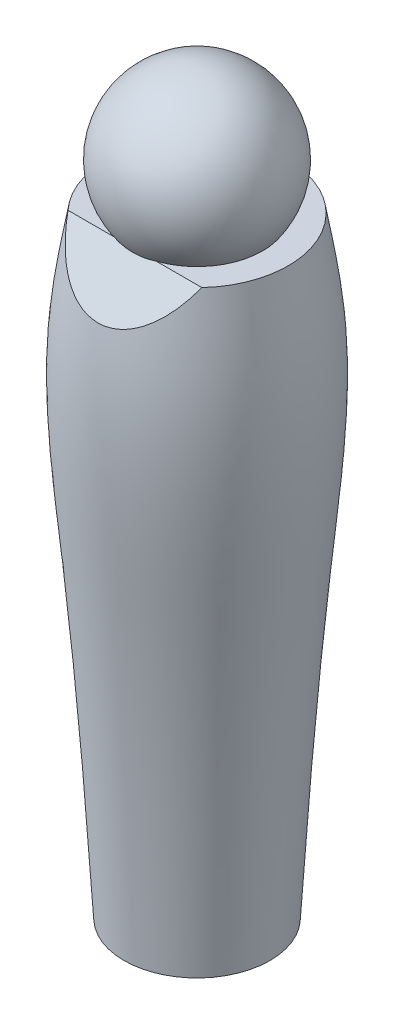
ISO-10303-21;
HEADER;
FILE_DESCRIPTION(('STEP AP214'),'2;1');
FILE_NAME('part.step','',(''),(''),'','','');
FILE_SCHEMA(('AUTOMOTIVE_DESIGN { 1 0 10303 214 1 1 1 1 }'));
ENDSEC;
DATA;
#1=APPLICATION_CONTEXT('core data for automotive mechanical design processes');
#2=APPLICATION_PROTOCOL_DEFINITION('international standard','automotive_design',2000,#1);
#3=PRODUCT_CONTEXT('',#1,'mechanical');
#4=PRODUCT('Part','Part','',(#3));
#5=PRODUCT_RELATED_PRODUCT_CATEGORY('part','',(#4));
#6=PRODUCT_DEFINITION_FORMATION('','',#4);
#7=PRODUCT_DEFINITION_CONTEXT('part definition',#1,'design');
#8=PRODUCT_DEFINITION('design','',#6,#7);
#9=PRODUCT_DEFINITION_SHAPE('','',#8);
#10=(LENGTH_UNIT() NAMED_UNIT(*) SI_UNIT(.MILLI.,.METRE.));
#11=(NAMED_UNIT(*) PLANE_ANGLE_UNIT() SI_UNIT($,.RADIAN.));
#12=(NAMED_UNIT(*) SI_UNIT($,.STERADIAN.) SOLID_ANGLE_UNIT());
#13=UNCERTAINTY_MEASURE_WITH_UNIT(LENGTH_MEASURE(1.E-05),#10,'distance_accuracy_value','');
#14=(GEOMETRIC_REPRESENTATION_CONTEXT(3) GLOBAL_UNCERTAINTY_ASSIGNED_CONTEXT((#13)) GLOBAL_UNIT_ASSIGNED_CONTEXT((#10,
#11,#12)) REPRESENTATION_CONTEXT('',''));
#15=CARTESIAN_POINT('',(0.,0.,0.));
#16=DIRECTION('',(0.,0.,1.));
#17=DIRECTION('',(1.,0.,0.));
#18=AXIS2_PLACEMENT_3D('',#15,#16,#17);
#19=CARTESIAN_POINT('',(-0.000106823470999014,-142.651049481871,0.0732170398389872));
#20=DIRECTION('',(0.,1.,0.));
#21=DIRECTION('',(0.,0.,1.));
#22=AXIS2_PLACEMENT_3D('',#19,#20,#21);
#23=PLANE('',#22);
#24=CARTESIAN_POINT('',(-0.000106823471053433,-142.651049481871,0.0732170398389872));
#25=DIRECTION('',(0.,1.,0.));
#26=DIRECTION('',(0.,0.,1.));
#27=AXIS2_PLACEMENT_3D('',#24,#25,#26);
#28=CIRCLE('',#27,28.1940000000001);
#29=CARTESIAN_POINT('',(-0.000106823471053433,-142.651049481871,28.267217039839));
#30=VERTEX_POINT('',#29);
#31=EDGE_CURVE('E94',#30,#30,#28,.T.);
#32=ORIENTED_EDGE('',*,*,#31,.F.);
#33=EDGE_LOOP('',(#32));
#34=FACE_BOUND('',#33,.T.);
#35=CARTESIAN_POINT('',(-0.000106823471053433,-142.651049481871,0.0732170398389727));
#36=DIRECTION('',(0.,1.,0.));
#37=DIRECTION('',(0.,0.,1.));
#38=AXIS2_PLACEMENT_3D('',#35,#36,#37);
#39=CIRCLE('',#38,26.1277921952238);
#40=CARTESIAN_POINT('',(-0.000106823471053433,-142.651049481871,26.2010092350628));
#41=VERTEX_POINT('',#40);
#42=EDGE_CURVE('E40',#41,#41,#39,.F.);
#43=ORIENTED_EDGE('',*,*,#42,.F.);
#44=EDGE_LOOP('',(#43));
#45=FACE_BOUND('',#44,.T.);
#46=ADVANCED_FACE('F36',(#34,#45),#23,.F.);
#47=CARTESIAN_POINT('',(-0.000106823471071218,93.1917605181294,0.0732170398389872));
#48=DIRECTION('',(0.,-1.,0.));
#49=DIRECTION('',(0.,0.,-1.));
#50=AXIS2_PLACEMENT_3D('',#47,#48,#49);
#51=PLANE('',#50);
#52=DIRECTION('',(1.,0.,0.));
#53=VECTOR('',#52,1.);
#54=CARTESIAN_POINT('',(-42.291106823471,93.1917605181294,24.038117039839));
#55=LINE('',#54,#53);
#56=CARTESIAN_POINT('',(-25.8403346521881,93.1917605181294,24.038117039839));
#57=VERTEX_POINT('',#56);
#58=CARTESIAN_POINT('',(-8.18486921305213,93.1917605181294,24.038117039839));
#59=VERTEX_POINT('',#58);
#60=EDGE_CURVE('E57',#57,#59,#55,.T.);
#61=ORIENTED_EDGE('',*,*,#60,.T.);
#62=CARTESIAN_POINT('',(-0.000106823471053433,93.1917605181294,0.0732170398389872));
#63=DIRECTION('',(0.,-1.,0.));
#64=DIRECTION('',(0.,0.,-1.));
#65=AXIS2_PLACEMENT_3D('',#62,#63,#64);
#66=CIRCLE('',#65,25.3240353692673);
#67=CARTESIAN_POINT('',(8.18465556611003,93.1917605181294,24.038117039839));
#68=VERTEX_POINT('',#67);
#69=EDGE_CURVE('E51',#59,#68,#66,.T.);
#70=ORIENTED_EDGE('',*,*,#69,.T.);
#71=CARTESIAN_POINT('',(25.840121005246,93.1917605181294,24.038117039839));
#72=VERTEX_POINT('',#71);
#73=EDGE_CURVE('E67',#68,#72,#55,.T.);
#74=ORIENTED_EDGE('',*,*,#73,.T.);
#75=CARTESIAN_POINT('',(-0.000106823471053433,93.1917605181294,0.0732170398389872));
#76=DIRECTION('',(0.,1.,0.));
#77=DIRECTION('',(0.,0.,1.));
#78=AXIS2_PLACEMENT_3D('',#75,#76,#77);
#79=CIRCLE('',#78,35.2425);
#80=EDGE_CURVE('E72',#72,#57,#79,.T.);
#81=ORIENTED_EDGE('',*,*,#80,.T.);
#82=EDGE_LOOP('',(#61,#70,#74,#81));
#83=FACE_BOUND('',#82,.T.);
#84=ADVANCED_FACE('F38',(#83),#51,.F.);
#85=CARTESIAN_POINT('',(28.193893176529,-142.651049481871,0.0732170398389872));
#86=CARTESIAN_POINT('',(29.1849265112481,-125.450319322413,0.0732170398389872));
#87=CARTESIAN_POINT('',(31.5346680360481,-84.6673622849336,0.0732170398389872));
#88=CARTESIAN_POINT('',(36.7234945699819,-17.7865266360393,0.0732170398389872));
#89=CARTESIAN_POINT('',(43.9285832765321,44.1711020041314,0.0732170398389872));
#90=CARTESIAN_POINT('',(37.2722571288859,81.7361894918486,0.0732170398389872));
#91=CARTESIAN_POINT('',(35.242393176529,93.1917605181294,0.0732170398389872));
#92=B_SPLINE_CURVE_WITH_KNOTS('',3,(#85,#86,#87,#88,#89,#90,#91),.UNSPECIFIED.,.F.,.F.,(4,1,1,1,
4),(0.,0.218353858385836,0.517717326123008,0.852926645594824,1.),.UNSPECIFIED.);
#93=CARTESIAN_POINT('',(-0.000106823471053433,301.727197623393,0.0732170398389872));
#94=DIRECTION('',(0.,1.,0.));
#95=AXIS1_PLACEMENT('',#93,#94);
#96=SURFACE_OF_REVOLUTION('',#92,#95);
#97=ORIENTED_EDGE('',*,*,#80,.F.);
#98=CARTESIAN_POINT('',(25.840121005246,93.1917605181294,24.038117039839));
#99=CARTESIAN_POINT('',(25.6895298039253,92.8958079580178,24.277608634792));
#100=CARTESIAN_POINT('',(25.5350677792823,92.601052944279,24.5161311477722));
#101=CARTESIAN_POINT('',(25.2181732985208,92.0141274637683,24.9910846990883));
#102=CARTESIAN_POINT('',(25.0557404534524,91.7219571239427,25.2275156346965));
#103=CARTESIAN_POINT('',(24.5552311118422,90.8480197075684,25.9347258229028));
#104=CARTESIAN_POINT('',(24.2047858554972,90.2704885459965,26.4020772760134));
#105=CARTESIAN_POINT('',(23.4688454465555,89.1283248806466,27.3263422927072));
#106=CARTESIAN_POINT('',(23.0833147193411,88.5637062115956,27.7832446609121));
#107=CARTESIAN_POINT('',(22.2695835346927,87.4422330336387,28.690766460976));
#108=CARTESIAN_POINT('',(21.8408350397695,86.8856178704518,29.1411922087933));
#109=CARTESIAN_POINT('',(20.9438909997317,85.7925526701007,30.0257256222603));
#110=CARTESIAN_POINT('',(20.4757304187834,85.2560853574517,30.4598472676283));
#111=CARTESIAN_POINT('',(19.497924878642,84.2069629434849,31.3088211711728));
#112=CARTESIAN_POINT('',(18.9883079211919,83.6942921304222,31.7236861436534));
#113=CARTESIAN_POINT('',(17.9693568702435,82.7381631275821,32.4974076474806));
#114=CARTESIAN_POINT('',(17.4634845824746,82.2924873174952,32.8580587280102));
#115=CARTESIAN_POINT('',(16.6763716042334,81.6448612075648,33.3821326199272));
#116=CARTESIAN_POINT('',(16.4092762139576,81.432462098005,33.5540108476266));
#117=CARTESIAN_POINT('',(15.8654407387752,81.0151272540907,33.8917277687469));
#118=CARTESIAN_POINT('',(15.5886976044564,80.8101939221142,34.0575645181083));
#119=CARTESIAN_POINT('',(14.7464230745456,80.209352837439,34.5437788952637));
#120=CARTESIAN_POINT('',(14.1665088800498,79.825468955304,34.8544265314072));
#121=CARTESIAN_POINT('',(12.9686312626498,79.0955817708766,35.4450679702528));
#122=CARTESIAN_POINT('',(12.3506800545525,78.7495664060225,35.7250715342562));
#123=CARTESIAN_POINT('',(11.192624548035,78.1598193039508,36.2023084064118));
#124=CARTESIAN_POINT('',(10.6585825143611,77.9088956251132,36.4053615985641));
#125=CARTESIAN_POINT('',(9.5670202019745,77.4399954190682,36.7848063926122));
#126=CARTESIAN_POINT('',(9.00950200997717,77.2220159714319,36.9612003577859));
#127=CARTESIAN_POINT('',(7.87309115453503,76.8225223864813,37.2844797232264));
#128=CARTESIAN_POINT('',(7.29419554471836,76.641013298117,37.431361037767));
#129=CARTESIAN_POINT('',(6.11811212926315,76.3178752203708,37.6928517766892));
#130=CARTESIAN_POINT('',(5.52092426831805,76.1762463515797,37.807461103486));
#131=CARTESIAN_POINT('',(4.51104980093859,75.9753377813698,37.9700409233773));
#132=CARTESIAN_POINT('',(4.10218317792927,75.9042890843353,38.0275351574725));
#133=CARTESIAN_POINT('',(3.2794803758898,75.7822048017708,38.1263285571277));
#134=CARTESIAN_POINT('',(2.86564399954996,75.7311700135606,38.1676270774782));
#135=CARTESIAN_POINT('',(2.03463842408645,75.6496704866691,38.2335783626294));
#136=CARTESIAN_POINT('',(1.61746927693331,75.6192054278588,38.2582313864859));
#137=CARTESIAN_POINT('',(0.781649776591957,75.5791820468258,38.2906192237643));
#138=CARTESIAN_POINT('',(0.36300013418355,75.5696147775017,38.2983612773857));
#139=CARTESIAN_POINT('',(-0.47423481417566,75.5714689587033,38.296860831459));
#140=CARTESIAN_POINT('',(-0.892820118755922,75.5828908072378,38.2876180098331));
#141=CARTESIAN_POINT('',(-1.7281068833485,75.6265883637229,38.2522569455659));
#142=CARTESIAN_POINT('',(-2.14480858044461,75.6588613691955,38.2261408898316));
#143=CARTESIAN_POINT('',(-3.10939520895445,75.7577252835917,38.1461379443152));
#144=CARTESIAN_POINT('',(-3.65599380743049,75.8320517378438,38.0859912739525));
#145=CARTESIAN_POINT('',(-4.73935592231675,76.0153179085259,37.9376880881275));
#146=CARTESIAN_POINT('',(-5.27612059209508,76.1242535379889,37.8495348799327));
#147=CARTESIAN_POINT('',(-6.33690520172901,76.3748896727341,37.6467143750505));
#148=CARTESIAN_POINT('',(-6.86092302486967,76.5165955792823,37.5320427075349));
#149=CARTESIAN_POINT('',(-7.89360214266786,76.8305369933039,37.2779941196886));
#150=CARTESIAN_POINT('',(-8.4022610745791,77.0027771703175,37.1386134206589));
#151=CARTESIAN_POINT('',(-9.56141085900302,77.4346839359465,36.7891045664949));
#152=CARTESIAN_POINT('',(-10.2055262830327,77.7047295894637,36.5705774341511));
#153=CARTESIAN_POINT('',(-11.460557866961,78.2879587963719,36.0986149921536));
#154=CARTESIAN_POINT('',(-12.071464959967,78.6011540492461,35.84517021501));
#155=CARTESIAN_POINT('',(-13.2593029817849,79.26560318597,35.3074827442234));
#156=CARTESIAN_POINT('',(-13.836179644329,79.6169154483419,35.0231928093423));
#157=CARTESIAN_POINT('',(-14.95442823607,80.352062427187,34.4282950242982));
#158=CARTESIAN_POINT('',(-15.4957989264872,80.7358982773165,34.1176862567544));
#159=CARTESIAN_POINT('',(-16.5249076186736,81.517514760607,33.4851842836196));
#160=CARTESIAN_POINT('',(-17.0138613914574,81.9143324198226,33.1640703386169));
#161=CARTESIAN_POINT('',(-17.9598982532746,82.7305254779728,32.5035882086015));
#162=CARTESIAN_POINT('',(-18.4169681000185,83.1499101230184,32.1642125414238));
#163=CARTESIAN_POINT('',(-19.3001093753574,84.0080322943431,31.4698004120013));
#164=CARTESIAN_POINT('',(-19.7261748190707,84.446773530972,31.1147609472562));
#165=CARTESIAN_POINT('',(-20.5490430789029,85.3415505184762,30.3906869004432));
#166=CARTESIAN_POINT('',(-20.9457979895737,85.7976128145515,30.0216308373909));
#167=CARTESIAN_POINT('',(-21.7104506868555,86.7239329143106,29.2720313811647));
#168=CARTESIAN_POINT('',(-22.0783557869246,87.1941870782069,28.8914909333903));
#169=CARTESIAN_POINT('',(-22.7865944366627,88.1468928678372,28.1205395721532));
#170=CARTESIAN_POINT('',(-23.1269339762918,88.6293418136031,27.7301308273823));
#171=CARTESIAN_POINT('',(-23.8994453193163,89.7808292211076,26.7983208248344));
#172=CARTESIAN_POINT('',(-24.3204670769128,90.4544077967271,26.2532456028445));
#173=CARTESIAN_POINT('',(-24.9166384480341,91.4748380932667,25.4274900183529));
#174=CARTESIAN_POINT('',(-25.1089892372002,91.815710305634,25.1516484112242));
#175=CARTESIAN_POINT('',(-25.4827687833059,92.5010940279125,24.5970201939807));
#176=CARTESIAN_POINT('',(-25.6641965070684,92.8456058784738,24.318233308204));
#177=CARTESIAN_POINT('',(-25.8403346521881,93.1917605181294,24.038117039839));
#178=B_SPLINE_CURVE_WITH_KNOTS('',3,(#98,#99,#100,#101,#102,#103,#104,#105,#106,#107,#108,#109,
#110,#111,#112,#113,#114,#115,#116,#117,#118,#119,#120,#121,#122,#123,#124,#125,#126,#127,#128,
#129,#130,#131,#132,#133,#134,#135,#136,#137,#138,#139,#140,#141,#142,#143,#144,#145,#146,#147,
#148,#149,#150,#151,#152,#153,#154,#155,#156,#157,#158,#159,#160,#161,#162,#163,#164,#165,#166,
#167,#168,#169,#170,#171,#172,#173,#174,#175,#176,#177),.UNSPECIFIED.,.F.,.F.,(4,2,2,2,2,2,2,2,
2,2,2,2,2,2,2,2,2,2,2,2,2,2,2,2,2,2,2,2,2,2,2,2,2,2,2,2,2,2,2,4),(0.,1.22820701481796,
2.45647402182,4.91989697811584,7.38584613840165,9.8883680673311,12.3886928354828,
14.8873425610568,17.1793604854918,18.3254262786642,19.4718576588915,21.7545004955855,
24.0364140944044,25.9067468493674,27.7769137063478,29.6473392907807,31.5177705309966,
32.7739022828327,34.0300840717182,35.2862463100535,36.5418706342852,37.7975187686992,
39.0530041936328,40.7156826603295,42.3781648557183,44.0409212604584,45.703932166661,
47.8961496969956,50.0889627942372,52.2851830352122,54.4814798601168,56.6006532377733,
58.7207015908813,60.8411581042284,62.9650069683386,65.0883156821733,67.2111617589818,
70.0996388636181,71.5360218137312,72.9725404138662),.UNSPECIFIED.);
#179=EDGE_CURVE('E45',#72,#57,#178,.T.);
#180=ORIENTED_EDGE('',*,*,#179,.T.);
#181=EDGE_LOOP('',(#97,#180));
#182=FACE_BOUND('',#181,.T.);
#183=ORIENTED_EDGE('',*,*,#31,.T.);
#184=EDGE_LOOP('',(#183));
#185=FACE_BOUND('',#184,.T.);
#186=ADVANCED_FACE('F83',(#182,#185),#96,.T.);
#187=CARTESIAN_POINT('',(-42.291106823471,93.1917605181294,24.038117039839));
#188=DIRECTION('',(0.,-0.629056917612885,-0.777359244110068));
#189=DIRECTION('',(0.,0.777359244110068,-0.629056917612885));
#190=AXIS2_PLACEMENT_3D('',#187,#188,#189);
#191=PLANE('',#190);
#192=ORIENTED_EDGE('',*,*,#73,.F.);
#193=CARTESIAN_POINT('',(-0.000106823471053433,115.729345581534,5.80018663913469));
#194=DIRECTION('',(0.,-0.629056917612885,-0.777359244110068));
#195=DIRECTION('',(0.,0.777359244110068,-0.629056917612885));
#196=AXIS2_PLACEMENT_3D('',#193,#194,#195);
#197=CIRCLE('',#196,30.1256565267055);
#198=EDGE_CURVE('E11',#68,#59,#197,.T.);
#199=ORIENTED_EDGE('',*,*,#198,.T.);
#200=ORIENTED_EDGE('',*,*,#60,.F.);
#201=ORIENTED_EDGE('',*,*,#179,.F.);
#202=EDGE_LOOP('',(#192,#199,#200,#201));
#203=FACE_BOUND('',#202,.T.);
#204=ADVANCED_FACE('F69',(#203),#191,.F.);
#205=CARTESIAN_POINT('',(-0.000106823471053433,111.094950518129,0.0732170398389872));
#206=DIRECTION('',(0.,-1.,0.));
#207=DIRECTION('',(0.,0.,1.));
#208=AXIS2_PLACEMENT_3D('',#205,#206,#207);
#209=SPHERICAL_SURFACE('',#208,31.0134);
#210=ORIENTED_EDGE('',*,*,#69,.F.);
#211=ORIENTED_EDGE('',*,*,#198,.F.);
#212=EDGE_LOOP('',(#210,#211));
#213=FACE_BOUND('',#212,.T.);
#214=ADVANCED_FACE('F63',(#213),#209,.T.);
#215=CARTESIAN_POINT('',(-0.000106823471053433,-147.866939481871,0.0732170398389727));
#216=DIRECTION('',(0.,1.,0.));
#217=DIRECTION('',(0.,0.,1.));
#218=AXIS2_PLACEMENT_3D('',#215,#216,#217);
#219=SPHERICAL_SURFACE('',#218,26.64333);
#220=ORIENTED_EDGE('',*,*,#42,.T.);
#221=EDGE_LOOP('',(#220));
#222=FACE_BOUND('',#221,.T.);
#223=ADVANCED_FACE('F104',(#222),#219,.F.);
#224=CLOSED_SHELL('',(#46,#84,#186,#204,#214,#223));
#225=MANIFOLD_SOLID_BREP('B2',#224);
#226=ADVANCED_BREP_SHAPE_REPRESENTATION('',(#18,#225),#14);
#227=SHAPE_DEFINITION_REPRESENTATION(#9,#226);
ENDSEC;
END-ISO-10303-21;
